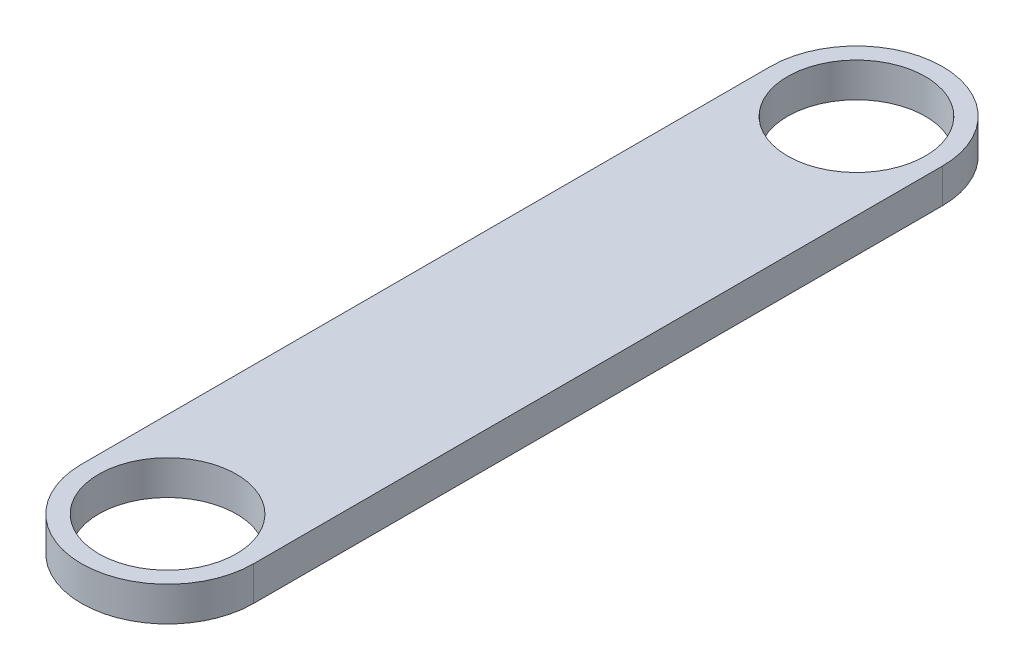
ISO-10303-21;
HEADER;
FILE_DESCRIPTION(('STEP AP214'),'2;1');
FILE_NAME('part.step','',(''),(''),'','','');
FILE_SCHEMA(('AUTOMOTIVE_DESIGN { 1 0 10303 214 1 1 1 1 }'));
ENDSEC;
DATA;
#1=APPLICATION_CONTEXT('core data for automotive mechanical design processes');
#2=APPLICATION_PROTOCOL_DEFINITION('international standard','automotive_design',2000,#1);
#3=PRODUCT_CONTEXT('',#1,'mechanical');
#4=PRODUCT('Part','Part','',(#3));
#5=PRODUCT_RELATED_PRODUCT_CATEGORY('part','',(#4));
#6=PRODUCT_DEFINITION_FORMATION('','',#4);
#7=PRODUCT_DEFINITION_CONTEXT('part definition',#1,'design');
#8=PRODUCT_DEFINITION('design','',#6,#7);
#9=PRODUCT_DEFINITION_SHAPE('','',#8);
#10=(LENGTH_UNIT() NAMED_UNIT(*) SI_UNIT(.MILLI.,.METRE.));
#11=(NAMED_UNIT(*) PLANE_ANGLE_UNIT() SI_UNIT($,.RADIAN.));
#12=(NAMED_UNIT(*) SI_UNIT($,.STERADIAN.) SOLID_ANGLE_UNIT());
#13=UNCERTAINTY_MEASURE_WITH_UNIT(LENGTH_MEASURE(1.E-05),#10,'distance_accuracy_value','');
#14=(GEOMETRIC_REPRESENTATION_CONTEXT(3) GLOBAL_UNCERTAINTY_ASSIGNED_CONTEXT((#13)) GLOBAL_UNIT_ASSIGNED_CONTEXT((#10,
#11,#12)) REPRESENTATION_CONTEXT('',''));
#15=CARTESIAN_POINT('',(0.,0.,0.));
#16=DIRECTION('',(0.,0.,1.));
#17=DIRECTION('',(1.,0.,0.));
#18=AXIS2_PLACEMENT_3D('',#15,#16,#17);
#19=CARTESIAN_POINT('',(0.,1.,0.));
#20=DIRECTION('',(0.,1.,0.));
#21=DIRECTION('',(0.,0.,1.));
#22=AXIS2_PLACEMENT_3D('',#19,#20,#21);
#23=PLANE('',#22);
#24=CARTESIAN_POINT('',(0.,1.,0.));
#25=DIRECTION('',(0.,1.,0.));
#26=DIRECTION('',(0.,0.,1.));
#27=AXIS2_PLACEMENT_3D('',#24,#25,#26);
#28=CIRCLE('',#27,2.);
#29=CARTESIAN_POINT('',(0.,1.,2.));
#30=VERTEX_POINT('',#29);
#31=EDGE_CURVE('E112',#30,#30,#28,.T.);
#32=ORIENTED_EDGE('',*,*,#31,.F.);
#33=EDGE_LOOP('',(#32));
#34=FACE_BOUND('',#33,.T.);
#35=CARTESIAN_POINT('',(0.,1.,0.));
#36=DIRECTION('',(0.,1.,0.));
#37=DIRECTION('',(0.,0.,1.));
#38=AXIS2_PLACEMENT_3D('',#35,#36,#37);
#39=CIRCLE('',#38,2.5);
#40=CARTESIAN_POINT('',(-2.5,1.,0.));
#41=VERTEX_POINT('',#40);
#42=CARTESIAN_POINT('',(2.5,1.,0.));
#43=VERTEX_POINT('',#42);
#44=EDGE_CURVE('E92',#41,#43,#39,.T.);
#45=ORIENTED_EDGE('',*,*,#44,.T.);
#46=DIRECTION('',(0.,0.,-1.));
#47=VECTOR('',#46,1.);
#48=CARTESIAN_POINT('',(2.5,1.,0.));
#49=LINE('',#48,#47);
#50=CARTESIAN_POINT('',(2.5,1.,-20.));
#51=VERTEX_POINT('',#50);
#52=EDGE_CURVE('E87',#43,#51,#49,.T.);
#53=ORIENTED_EDGE('',*,*,#52,.T.);
#54=CARTESIAN_POINT('',(0.,1.,-20.));
#55=DIRECTION('',(0.,1.,0.));
#56=DIRECTION('',(0.,0.,1.));
#57=AXIS2_PLACEMENT_3D('',#54,#55,#56);
#58=CIRCLE('',#57,2.5);
#59=CARTESIAN_POINT('',(-2.5,1.,-20.));
#60=VERTEX_POINT('',#59);
#61=EDGE_CURVE('E90',#51,#60,#58,.T.);
#62=ORIENTED_EDGE('',*,*,#61,.T.);
#63=DIRECTION('',(0.,0.,1.));
#64=VECTOR('',#63,1.);
#65=CARTESIAN_POINT('',(-2.5,1.,0.));
#66=LINE('',#65,#64);
#67=EDGE_CURVE('E57',#60,#41,#66,.T.);
#68=ORIENTED_EDGE('',*,*,#67,.T.);
#69=EDGE_LOOP('',(#45,#53,#62,#68));
#70=FACE_BOUND('',#69,.T.);
#71=CARTESIAN_POINT('',(0.,1.,-20.));
#72=DIRECTION('',(0.,1.,0.));
#73=DIRECTION('',(0.,0.,1.));
#74=AXIS2_PLACEMENT_3D('',#71,#72,#73);
#75=CIRCLE('',#74,2.);
#76=CARTESIAN_POINT('',(0.,1.,-18.));
#77=VERTEX_POINT('',#76);
#78=EDGE_CURVE('E134',#77,#77,#75,.T.);
#79=ORIENTED_EDGE('',*,*,#78,.F.);
#80=EDGE_LOOP('',(#79));
#81=FACE_BOUND('',#80,.T.);
#82=ADVANCED_FACE('F39',(#34,#70,#81),#23,.T.);
#83=CARTESIAN_POINT('',(0.,0.,0.));
#84=DIRECTION('',(0.,1.,0.));
#85=DIRECTION('',(0.,0.,1.));
#86=AXIS2_PLACEMENT_3D('',#83,#84,#85);
#87=PLANE('',#86);
#88=CARTESIAN_POINT('',(0.,0.,0.));
#89=DIRECTION('',(0.,1.,0.));
#90=DIRECTION('',(0.,0.,1.));
#91=AXIS2_PLACEMENT_3D('',#88,#89,#90);
#92=CIRCLE('',#91,2.5);
#93=CARTESIAN_POINT('',(-2.5,0.,0.));
#94=VERTEX_POINT('',#93);
#95=CARTESIAN_POINT('',(2.5,0.,0.));
#96=VERTEX_POINT('',#95);
#97=EDGE_CURVE('E108',#94,#96,#92,.T.);
#98=ORIENTED_EDGE('',*,*,#97,.F.);
#99=DIRECTION('',(0.,0.,1.));
#100=VECTOR('',#99,1.);
#101=CARTESIAN_POINT('',(-2.5,0.,0.));
#102=LINE('',#101,#100);
#103=CARTESIAN_POINT('',(-2.5,0.,-20.));
#104=VERTEX_POINT('',#103);
#105=EDGE_CURVE('E80',#104,#94,#102,.T.);
#106=ORIENTED_EDGE('',*,*,#105,.F.);
#107=CARTESIAN_POINT('',(0.,0.,-20.));
#108=DIRECTION('',(0.,1.,0.));
#109=DIRECTION('',(0.,0.,1.));
#110=AXIS2_PLACEMENT_3D('',#107,#108,#109);
#111=CIRCLE('',#110,2.5);
#112=CARTESIAN_POINT('',(2.5,0.,-20.));
#113=VERTEX_POINT('',#112);
#114=EDGE_CURVE('E74',#113,#104,#111,.T.);
#115=ORIENTED_EDGE('',*,*,#114,.F.);
#116=DIRECTION('',(0.,0.,-1.));
#117=VECTOR('',#116,1.);
#118=CARTESIAN_POINT('',(2.5,0.,0.));
#119=LINE('',#118,#117);
#120=EDGE_CURVE('E97',#96,#113,#119,.T.);
#121=ORIENTED_EDGE('',*,*,#120,.F.);
#122=EDGE_LOOP('',(#98,#106,#115,#121));
#123=FACE_BOUND('',#122,.T.);
#124=CARTESIAN_POINT('',(0.,0.,0.));
#125=DIRECTION('',(0.,1.,0.));
#126=DIRECTION('',(0.,0.,1.));
#127=AXIS2_PLACEMENT_3D('',#124,#125,#126);
#128=CIRCLE('',#127,2.);
#129=CARTESIAN_POINT('',(0.,0.,2.));
#130=VERTEX_POINT('',#129);
#131=EDGE_CURVE('E130',#130,#130,#128,.T.);
#132=ORIENTED_EDGE('',*,*,#131,.T.);
#133=EDGE_LOOP('',(#132));
#134=FACE_BOUND('',#133,.T.);
#135=CARTESIAN_POINT('',(0.,0.,-20.));
#136=DIRECTION('',(0.,1.,0.));
#137=DIRECTION('',(0.,0.,1.));
#138=AXIS2_PLACEMENT_3D('',#135,#136,#137);
#139=CIRCLE('',#138,2.);
#140=CARTESIAN_POINT('',(0.,0.,-18.));
#141=VERTEX_POINT('',#140);
#142=EDGE_CURVE('E138',#141,#141,#139,.T.);
#143=ORIENTED_EDGE('',*,*,#142,.T.);
#144=EDGE_LOOP('',(#143));
#145=FACE_BOUND('',#144,.T.);
#146=ADVANCED_FACE('F125',(#123,#134,#145),#87,.F.);
#147=CARTESIAN_POINT('',(0.,1.,0.));
#148=DIRECTION('',(0.,-1.,0.));
#149=DIRECTION('',(0.,0.,-1.));
#150=AXIS2_PLACEMENT_3D('',#147,#148,#149);
#151=CYLINDRICAL_SURFACE('',#150,2.5);
#152=ORIENTED_EDGE('',*,*,#97,.T.);
#153=DIRECTION('',(0.,-1.,0.));
#154=VECTOR('',#153,1.);
#155=CARTESIAN_POINT('',(2.5,1.,0.));
#156=LINE('',#155,#154);
#157=EDGE_CURVE('E11',#43,#96,#156,.T.);
#158=ORIENTED_EDGE('',*,*,#157,.F.);
#159=ORIENTED_EDGE('',*,*,#44,.F.);
#160=DIRECTION('',(0.,-1.,0.));
#161=VECTOR('',#160,1.);
#162=CARTESIAN_POINT('',(-2.5,1.,0.));
#163=LINE('',#162,#161);
#164=EDGE_CURVE('E104',#41,#94,#163,.T.);
#165=ORIENTED_EDGE('',*,*,#164,.T.);
#166=EDGE_LOOP('',(#152,#158,#159,#165));
#167=FACE_BOUND('',#166,.T.);
#168=ADVANCED_FACE('F41',(#167),#151,.T.);
#169=CARTESIAN_POINT('',(2.5,1.,0.));
#170=DIRECTION('',(-1.,0.,0.));
#171=DIRECTION('',(0.,0.,1.));
#172=AXIS2_PLACEMENT_3D('',#169,#170,#171);
#173=PLANE('',#172);
#174=ORIENTED_EDGE('',*,*,#120,.T.);
#175=DIRECTION('',(0.,-1.,0.));
#176=VECTOR('',#175,1.);
#177=CARTESIAN_POINT('',(2.5,1.,-20.));
#178=LINE('',#177,#176);
#179=EDGE_CURVE('E49',#51,#113,#178,.T.);
#180=ORIENTED_EDGE('',*,*,#179,.F.);
#181=ORIENTED_EDGE('',*,*,#52,.F.);
#182=ORIENTED_EDGE('',*,*,#157,.T.);
#183=EDGE_LOOP('',(#174,#180,#181,#182));
#184=FACE_BOUND('',#183,.T.);
#185=ADVANCED_FACE('F96',(#184),#173,.F.);
#186=CARTESIAN_POINT('',(0.,1.,-20.));
#187=DIRECTION('',(0.,-1.,0.));
#188=DIRECTION('',(0.,0.,-1.));
#189=AXIS2_PLACEMENT_3D('',#186,#187,#188);
#190=CYLINDRICAL_SURFACE('',#189,2.5);
#191=ORIENTED_EDGE('',*,*,#114,.T.);
#192=DIRECTION('',(0.,-1.,0.));
#193=VECTOR('',#192,1.);
#194=CARTESIAN_POINT('',(-2.5,1.,-20.));
#195=LINE('',#194,#193);
#196=EDGE_CURVE('E99',#60,#104,#195,.T.);
#197=ORIENTED_EDGE('',*,*,#196,.F.);
#198=ORIENTED_EDGE('',*,*,#61,.F.);
#199=ORIENTED_EDGE('',*,*,#179,.T.);
#200=EDGE_LOOP('',(#191,#197,#198,#199));
#201=FACE_BOUND('',#200,.T.);
#202=ADVANCED_FACE('F100',(#201),#190,.T.);
#203=CARTESIAN_POINT('',(-2.5,1.,0.));
#204=DIRECTION('',(1.,0.,0.));
#205=DIRECTION('',(0.,0.,-1.));
#206=AXIS2_PLACEMENT_3D('',#203,#204,#205);
#207=PLANE('',#206);
#208=ORIENTED_EDGE('',*,*,#105,.T.);
#209=ORIENTED_EDGE('',*,*,#164,.F.);
#210=ORIENTED_EDGE('',*,*,#67,.F.);
#211=ORIENTED_EDGE('',*,*,#196,.T.);
#212=EDGE_LOOP('',(#208,#209,#210,#211));
#213=FACE_BOUND('',#212,.T.);
#214=ADVANCED_FACE('F122',(#213),#207,.F.);
#215=CARTESIAN_POINT('',(0.,1.,0.));
#216=DIRECTION('',(0.,-1.,0.));
#217=DIRECTION('',(0.,0.,-1.));
#218=AXIS2_PLACEMENT_3D('',#215,#216,#217);
#219=CYLINDRICAL_SURFACE('',#218,2.);
#220=ORIENTED_EDGE('',*,*,#31,.T.);
#221=EDGE_LOOP('',(#220));
#222=FACE_BOUND('',#221,.T.);
#223=ORIENTED_EDGE('',*,*,#131,.F.);
#224=EDGE_LOOP('',(#223));
#225=FACE_BOUND('',#224,.T.);
#226=ADVANCED_FACE('F157',(#222,#225),#219,.F.);
#227=CARTESIAN_POINT('',(0.,1.,-20.));
#228=DIRECTION('',(0.,-1.,0.));
#229=DIRECTION('',(0.,0.,-1.));
#230=AXIS2_PLACEMENT_3D('',#227,#228,#229);
#231=CYLINDRICAL_SURFACE('',#230,2.);
#232=ORIENTED_EDGE('',*,*,#78,.T.);
#233=EDGE_LOOP('',(#232));
#234=FACE_BOUND('',#233,.T.);
#235=ORIENTED_EDGE('',*,*,#142,.F.);
#236=EDGE_LOOP('',(#235));
#237=FACE_BOUND('',#236,.T.);
#238=ADVANCED_FACE('F146',(#234,#237),#231,.F.);
#239=CLOSED_SHELL('',(#82,#146,#168,#185,#202,#214,#226,#238));
#240=MANIFOLD_SOLID_BREP('B2',#239);
#241=ADVANCED_BREP_SHAPE_REPRESENTATION('',(#18,#240),#14);
#242=SHAPE_DEFINITION_REPRESENTATION(#9,#241);
ENDSEC;
END-ISO-10303-21;
